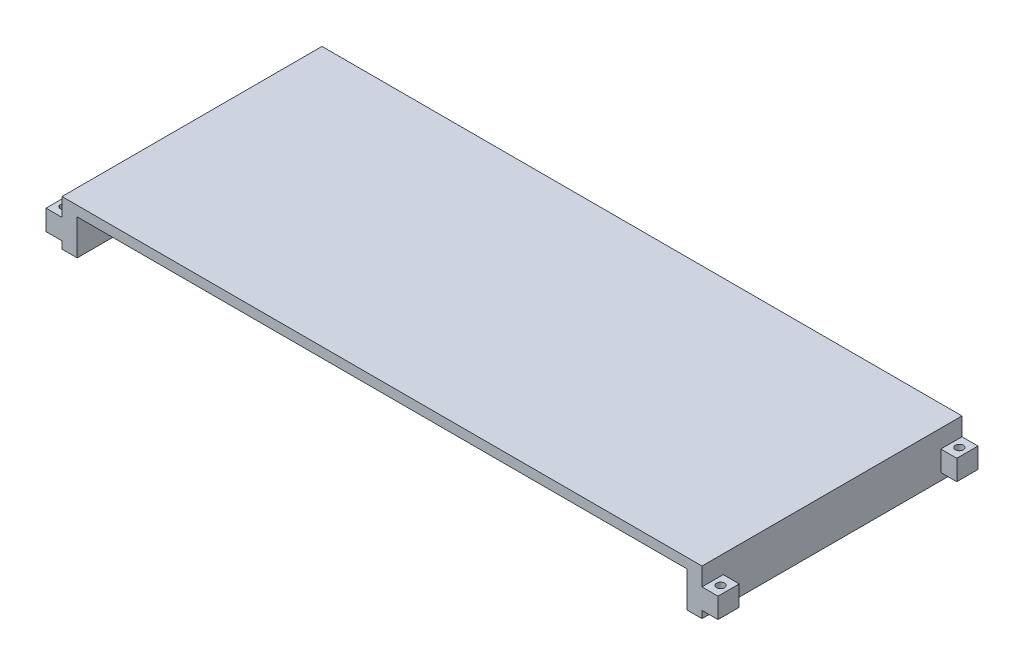
ISO-10303-21;
HEADER;
FILE_DESCRIPTION(('STEP AP214'),'2;1');
FILE_NAME('part.step','',(''),(''),'','','');
FILE_SCHEMA(('AUTOMOTIVE_DESIGN { 1 0 10303 214 1 1 1 1 }'));
ENDSEC;
DATA;
#1=APPLICATION_CONTEXT('core data for automotive mechanical design processes');
#2=APPLICATION_PROTOCOL_DEFINITION('international standard','automotive_design',2000,#1);
#3=PRODUCT_CONTEXT('',#1,'mechanical');
#4=PRODUCT('Part','Part','',(#3));
#5=PRODUCT_RELATED_PRODUCT_CATEGORY('part','',(#4));
#6=PRODUCT_DEFINITION_FORMATION('','',#4);
#7=PRODUCT_DEFINITION_CONTEXT('part definition',#1,'design');
#8=PRODUCT_DEFINITION('design','',#6,#7);
#9=PRODUCT_DEFINITION_SHAPE('','',#8);
#10=(LENGTH_UNIT() NAMED_UNIT(*) SI_UNIT(.MILLI.,.METRE.));
#11=(NAMED_UNIT(*) PLANE_ANGLE_UNIT() SI_UNIT($,.RADIAN.));
#12=(NAMED_UNIT(*) SI_UNIT($,.STERADIAN.) SOLID_ANGLE_UNIT());
#13=UNCERTAINTY_MEASURE_WITH_UNIT(LENGTH_MEASURE(1.E-05),#10,'distance_accuracy_value','');
#14=(GEOMETRIC_REPRESENTATION_CONTEXT(3) GLOBAL_UNCERTAINTY_ASSIGNED_CONTEXT((#13)) GLOBAL_UNIT_ASSIGNED_CONTEXT((#10,
#11,#12)) REPRESENTATION_CONTEXT('',''));
#15=CARTESIAN_POINT('',(0.,0.,0.));
#16=DIRECTION('',(0.,0.,1.));
#17=DIRECTION('',(1.,0.,0.));
#18=AXIS2_PLACEMENT_3D('',#15,#16,#17);
#19=CARTESIAN_POINT('',(0.,25.,0.));
#20=DIRECTION('',(1.,0.,0.));
#21=DIRECTION('',(0.,0.,-1.));
#22=AXIS2_PLACEMENT_3D('',#19,#20,#21);
#23=PLANE('',#22);
#24=DIRECTION('',(0.,0.,-1.));
#25=VECTOR('',#24,1.);
#26=CARTESIAN_POINT('',(0.,-20.2,650.));
#27=LINE('',#26,#25);
#28=CARTESIAN_POINT('',(0.,-20.2,650.));
#29=VERTEX_POINT('',#28);
#30=CARTESIAN_POINT('',(0.,-20.2,597.));
#31=VERTEX_POINT('',#30);
#32=EDGE_CURVE('E319',#29,#31,#27,.T.);
#33=ORIENTED_EDGE('',*,*,#32,.F.);
#34=DIRECTION('',(0.,-1.,0.));
#35=VECTOR('',#34,1.);
#36=CARTESIAN_POINT('',(0.,25.,650.));
#37=LINE('',#36,#35);
#38=CARTESIAN_POINT('',(0.,25.,650.));
#39=VERTEX_POINT('',#38);
#40=EDGE_CURVE('E11',#39,#29,#37,.T.);
#41=ORIENTED_EDGE('',*,*,#40,.F.);
#42=DIRECTION('',(0.,0.,1.));
#43=VECTOR('',#42,1.);
#44=CARTESIAN_POINT('',(0.,25.,0.));
#45=LINE('',#44,#43);
#46=CARTESIAN_POINT('',(0.,25.,0.));
#47=VERTEX_POINT('',#46);
#48=EDGE_CURVE('E420',#47,#39,#45,.T.);
#49=ORIENTED_EDGE('',*,*,#48,.F.);
#50=DIRECTION('',(0.,-1.,0.));
#51=VECTOR('',#50,1.);
#52=CARTESIAN_POINT('',(0.,25.,0.));
#53=LINE('',#52,#51);
#54=CARTESIAN_POINT('',(0.,-20.2,0.));
#55=VERTEX_POINT('',#54);
#56=EDGE_CURVE('E435',#47,#55,#53,.T.);
#57=ORIENTED_EDGE('',*,*,#56,.T.);
#58=DIRECTION('',(0.,0.,-1.));
#59=VECTOR('',#58,1.);
#60=CARTESIAN_POINT('',(0.,-20.2,0.));
#61=LINE('',#60,#59);
#62=CARTESIAN_POINT('',(0.,-20.2,53.));
#63=VERTEX_POINT('',#62);
#64=EDGE_CURVE('E333',#63,#55,#61,.T.);
#65=ORIENTED_EDGE('',*,*,#64,.F.);
#66=DIRECTION('',(0.,1.,0.));
#67=VECTOR('',#66,1.);
#68=CARTESIAN_POINT('',(0.,-71.,53.));
#69=LINE('',#68,#67);
#70=CARTESIAN_POINT('',(0.,-71.,53.));
#71=VERTEX_POINT('',#70);
#72=EDGE_CURVE('E342',#71,#63,#69,.T.);
#73=ORIENTED_EDGE('',*,*,#72,.F.);
#74=DIRECTION('',(0.,0.,1.));
#75=VECTOR('',#74,1.);
#76=CARTESIAN_POINT('',(0.,-71.,0.));
#77=LINE('',#76,#75);
#78=CARTESIAN_POINT('',(0.,-71.,0.));
#79=VERTEX_POINT('',#78);
#80=EDGE_CURVE('E321',#79,#71,#77,.T.);
#81=ORIENTED_EDGE('',*,*,#80,.F.);
#82=CARTESIAN_POINT('',(0.,-89.,0.));
#83=VERTEX_POINT('',#82);
#84=EDGE_CURVE('E430',#79,#83,#53,.T.);
#85=ORIENTED_EDGE('',*,*,#84,.T.);
#86=DIRECTION('',(0.,0.,-1.));
#87=VECTOR('',#86,1.);
#88=CARTESIAN_POINT('',(0.,-89.,0.));
#89=LINE('',#88,#87);
#90=CARTESIAN_POINT('',(0.,-89.,650.));
#91=VERTEX_POINT('',#90);
#92=EDGE_CURVE('E359',#91,#83,#89,.T.);
#93=ORIENTED_EDGE('',*,*,#92,.F.);
#94=CARTESIAN_POINT('',(0.,-71.,650.));
#95=VERTEX_POINT('',#94);
#96=EDGE_CURVE('E46',#95,#91,#37,.T.);
#97=ORIENTED_EDGE('',*,*,#96,.F.);
#98=DIRECTION('',(0.,0.,1.));
#99=VECTOR('',#98,1.);
#100=CARTESIAN_POINT('',(0.,-71.,650.));
#101=LINE('',#100,#99);
#102=CARTESIAN_POINT('',(0.,-71.,597.));
#103=VERTEX_POINT('',#102);
#104=EDGE_CURVE('E313',#103,#95,#101,.T.);
#105=ORIENTED_EDGE('',*,*,#104,.F.);
#106=DIRECTION('',(0.,-1.,0.));
#107=VECTOR('',#106,1.);
#108=CARTESIAN_POINT('',(0.,-71.,597.));
#109=LINE('',#108,#107);
#110=EDGE_CURVE('E316',#31,#103,#109,.T.);
#111=ORIENTED_EDGE('',*,*,#110,.F.);
#112=EDGE_LOOP('',(#33,#41,#49,#57,#65,#73,#81,#85,#93,#97,#105,#111));
#113=FACE_BOUND('',#112,.T.);
#114=ADVANCED_FACE('F38',(#113),#23,.F.);
#115=CARTESIAN_POINT('',(0.,0.,0.));
#116=DIRECTION('',(0.,1.,0.));
#117=DIRECTION('',(0.,0.,1.));
#118=AXIS2_PLACEMENT_3D('',#115,#116,#117);
#119=PLANE('',#118);
#120=DIRECTION('',(0.,0.,-1.));
#121=VECTOR('',#120,1.);
#122=CARTESIAN_POINT('',(1562.,0.,-2.83360843866747E-11));
#123=LINE('',#122,#121);
#124=CARTESIAN_POINT('',(1562.00000000001,0.,306.));
#125=VERTEX_POINT('',#124);
#126=CARTESIAN_POINT('',(1562.,0.,0.));
#127=VERTEX_POINT('',#126);
#128=EDGE_CURVE('E391',#125,#127,#123,.T.);
#129=ORIENTED_EDGE('',*,*,#128,.F.);
#130=DIRECTION('',(1.,0.,0.));
#131=VECTOR('',#130,1.);
#132=CARTESIAN_POINT('',(0.,0.,306.));
#133=LINE('',#132,#131);
#134=CARTESIAN_POINT('',(38.0000000000001,0.,306.));
#135=VERTEX_POINT('',#134);
#136=EDGE_CURVE('E389',#135,#125,#133,.T.);
#137=ORIENTED_EDGE('',*,*,#136,.F.);
#138=DIRECTION('',(0.,0.,-1.));
#139=VECTOR('',#138,1.);
#140=CARTESIAN_POINT('',(38.,0.,0.));
#141=LINE('',#140,#139);
#142=CARTESIAN_POINT('',(38.,0.,0.));
#143=VERTEX_POINT('',#142);
#144=EDGE_CURVE('E358',#135,#143,#141,.T.);
#145=ORIENTED_EDGE('',*,*,#144,.T.);
#146=DIRECTION('',(-1.,0.,0.));
#147=VECTOR('',#146,1.);
#148=CARTESIAN_POINT('',(0.,0.,0.));
#149=LINE('',#148,#147);
#150=EDGE_CURVE('E424',#127,#143,#149,.T.);
#151=ORIENTED_EDGE('',*,*,#150,.F.);
#152=EDGE_LOOP('',(#129,#137,#145,#151));
#153=FACE_BOUND('',#152,.T.);
#154=ADVANCED_FACE('F466',(#153),#119,.F.);
#155=CARTESIAN_POINT('',(0.,25.,650.));
#156=DIRECTION('',(0.,0.,-1.));
#157=DIRECTION('',(-1.,0.,0.));
#158=AXIS2_PLACEMENT_3D('',#155,#156,#157);
#159=PLANE('',#158);
#160=ORIENTED_EDGE('',*,*,#40,.T.);
#161=DIRECTION('',(1.,0.,0.));
#162=VECTOR('',#161,1.);
#163=CARTESIAN_POINT('',(-39.9999999999999,-20.2,650.));
#164=LINE('',#163,#162);
#165=CARTESIAN_POINT('',(-39.9999999999999,-20.2,650.));
#166=VERTEX_POINT('',#165);
#167=EDGE_CURVE('E302',#166,#29,#164,.T.);
#168=ORIENTED_EDGE('',*,*,#167,.F.);
#169=DIRECTION('',(0.,1.,0.));
#170=VECTOR('',#169,1.);
#171=CARTESIAN_POINT('',(-39.9999999999999,-71.,650.));
#172=LINE('',#171,#170);
#173=CARTESIAN_POINT('',(-39.9999999999999,-71.,650.));
#174=VERTEX_POINT('',#173);
#175=EDGE_CURVE('E317',#174,#166,#172,.T.);
#176=ORIENTED_EDGE('',*,*,#175,.F.);
#177=DIRECTION('',(1.,0.,0.));
#178=VECTOR('',#177,1.);
#179=CARTESIAN_POINT('',(-39.9999999999999,-71.,650.));
#180=LINE('',#179,#178);
#181=EDGE_CURVE('E310',#174,#95,#180,.T.);
#182=ORIENTED_EDGE('',*,*,#181,.T.);
#183=ORIENTED_EDGE('',*,*,#96,.T.);
#184=DIRECTION('',(-1.,0.,0.));
#185=VECTOR('',#184,1.);
#186=CARTESIAN_POINT('',(0.,-89.,650.));
#187=LINE('',#186,#185);
#188=CARTESIAN_POINT('',(38.0000000000001,-89.,650.));
#189=VERTEX_POINT('',#188);
#190=EDGE_CURVE('E379',#189,#91,#187,.T.);
#191=ORIENTED_EDGE('',*,*,#190,.F.);
#192=DIRECTION('',(0.,1.,0.));
#193=VECTOR('',#192,1.);
#194=CARTESIAN_POINT('',(38.0000000000001,-89.,650.));
#195=LINE('',#194,#193);
#196=CARTESIAN_POINT('',(38.0000000000001,0.,650.));
#197=VERTEX_POINT('',#196);
#198=EDGE_CURVE('E401',#189,#197,#195,.T.);
#199=ORIENTED_EDGE('',*,*,#198,.T.);
#200=DIRECTION('',(1.,0.,0.));
#201=VECTOR('',#200,1.);
#202=CARTESIAN_POINT('',(0.,0.,650.));
#203=LINE('',#202,#201);
#204=CARTESIAN_POINT('',(1562.,0.,650.));
#205=VERTEX_POINT('',#204);
#206=EDGE_CURVE('E419',#197,#205,#203,.T.);
#207=ORIENTED_EDGE('',*,*,#206,.T.);
#208=DIRECTION('',(0.,1.,0.));
#209=VECTOR('',#208,1.);
#210=CARTESIAN_POINT('',(1562.,-89.,650.));
#211=LINE('',#210,#209);
#212=CARTESIAN_POINT('',(1562.,-89.,650.));
#213=VERTEX_POINT('',#212);
#214=EDGE_CURVE('E407',#213,#205,#211,.T.);
#215=ORIENTED_EDGE('',*,*,#214,.F.);
#216=CARTESIAN_POINT('',(1600.,-89.,650.));
#217=VERTEX_POINT('',#216);
#218=EDGE_CURVE('E376',#217,#213,#187,.T.);
#219=ORIENTED_EDGE('',*,*,#218,.F.);
#220=DIRECTION('',(0.,-1.,0.));
#221=VECTOR('',#220,1.);
#222=CARTESIAN_POINT('',(1600.,25.,650.));
#223=LINE('',#222,#221);
#224=CARTESIAN_POINT('',(1600.,-71.,650.));
#225=VERTEX_POINT('',#224);
#226=EDGE_CURVE('E231',#225,#217,#223,.T.);
#227=ORIENTED_EDGE('',*,*,#226,.F.);
#228=DIRECTION('',(-1.,0.,0.));
#229=VECTOR('',#228,1.);
#230=CARTESIAN_POINT('',(1640.,-71.,650.));
#231=LINE('',#230,#229);
#232=CARTESIAN_POINT('',(1640.,-71.,650.));
#233=VERTEX_POINT('',#232);
#234=EDGE_CURVE('E225',#233,#225,#231,.T.);
#235=ORIENTED_EDGE('',*,*,#234,.F.);
#236=DIRECTION('',(0.,1.,0.));
#237=VECTOR('',#236,1.);
#238=CARTESIAN_POINT('',(1640.,-71.,650.));
#239=LINE('',#238,#237);
#240=CARTESIAN_POINT('',(1640.,-20.2,650.));
#241=VERTEX_POINT('',#240);
#242=EDGE_CURVE('E228',#233,#241,#239,.T.);
#243=ORIENTED_EDGE('',*,*,#242,.T.);
#244=DIRECTION('',(-1.,0.,0.));
#245=VECTOR('',#244,1.);
#246=CARTESIAN_POINT('',(1640.,-20.2,650.));
#247=LINE('',#246,#245);
#248=CARTESIAN_POINT('',(1600.,-20.2,650.));
#249=VERTEX_POINT('',#248);
#250=EDGE_CURVE('E256',#241,#249,#247,.T.);
#251=ORIENTED_EDGE('',*,*,#250,.T.);
#252=CARTESIAN_POINT('',(1600.,25.,650.));
#253=VERTEX_POINT('',#252);
#254=EDGE_CURVE('E441',#253,#249,#223,.T.);
#255=ORIENTED_EDGE('',*,*,#254,.F.);
#256=DIRECTION('',(1.,0.,0.));
#257=VECTOR('',#256,1.);
#258=CARTESIAN_POINT('',(0.,25.,650.));
#259=LINE('',#258,#257);
#260=EDGE_CURVE('E423',#39,#253,#259,.T.);
#261=ORIENTED_EDGE('',*,*,#260,.F.);
#262=EDGE_LOOP('',(#160,#168,#176,#182,#183,#191,#199,#207,#215,#219,#227,#235,#243,#251,#255,#261));
#263=FACE_BOUND('',#262,.T.);
#264=ADVANCED_FACE('F227',(#263),#159,.F.);
#265=CARTESIAN_POINT('',(1600.,25.,0.));
#266=DIRECTION('',(-1.,0.,0.));
#267=DIRECTION('',(0.,0.,1.));
#268=AXIS2_PLACEMENT_3D('',#265,#266,#267);
#269=PLANE('',#268);
#270=DIRECTION('',(0.,-1.,0.));
#271=VECTOR('',#270,1.);
#272=CARTESIAN_POINT('',(1600.,-71.,597.));
#273=LINE('',#272,#271);
#274=CARTESIAN_POINT('',(1600.,-20.2,597.));
#275=VERTEX_POINT('',#274);
#276=CARTESIAN_POINT('',(1600.,-71.,597.));
#277=VERTEX_POINT('',#276);
#278=EDGE_CURVE('E54',#275,#277,#273,.T.);
#279=ORIENTED_EDGE('',*,*,#278,.T.);
#280=DIRECTION('',(0.,0.,1.));
#281=VECTOR('',#280,1.);
#282=CARTESIAN_POINT('',(1600.,-71.,650.));
#283=LINE('',#282,#281);
#284=EDGE_CURVE('E257',#277,#225,#283,.T.);
#285=ORIENTED_EDGE('',*,*,#284,.T.);
#286=ORIENTED_EDGE('',*,*,#226,.T.);
#287=DIRECTION('',(0.,0.,1.));
#288=VECTOR('',#287,1.);
#289=CARTESIAN_POINT('',(1600.,-89.,0.));
#290=LINE('',#289,#288);
#291=CARTESIAN_POINT('',(1600.,-89.,0.));
#292=VERTEX_POINT('',#291);
#293=EDGE_CURVE('E373',#292,#217,#290,.T.);
#294=ORIENTED_EDGE('',*,*,#293,.F.);
#295=DIRECTION('',(0.,-1.,0.));
#296=VECTOR('',#295,1.);
#297=CARTESIAN_POINT('',(1600.,25.,0.));
#298=LINE('',#297,#296);
#299=CARTESIAN_POINT('',(1600.,-71.,-2.73285667600039E-13));
#300=VERTEX_POINT('',#299);
#301=EDGE_CURVE('E437',#300,#292,#298,.T.);
#302=ORIENTED_EDGE('',*,*,#301,.F.);
#303=DIRECTION('',(0.,0.,1.));
#304=VECTOR('',#303,1.);
#305=CARTESIAN_POINT('',(1600.,-71.,-2.73285667600039E-13));
#306=LINE('',#305,#304);
#307=CARTESIAN_POINT('',(1600.,-71.,52.9999999999997));
#308=VERTEX_POINT('',#307);
#309=EDGE_CURVE('E271',#300,#308,#306,.T.);
#310=ORIENTED_EDGE('',*,*,#309,.T.);
#311=DIRECTION('',(0.,1.,0.));
#312=VECTOR('',#311,1.);
#313=CARTESIAN_POINT('',(1600.,-71.,52.9999999999997));
#314=LINE('',#313,#312);
#315=CARTESIAN_POINT('',(1600.,-20.2,52.9999999999997));
#316=VERTEX_POINT('',#315);
#317=EDGE_CURVE('E281',#308,#316,#314,.T.);
#318=ORIENTED_EDGE('',*,*,#317,.T.);
#319=DIRECTION('',(0.,0.,-1.));
#320=VECTOR('',#319,1.);
#321=CARTESIAN_POINT('',(1600.,-20.2,-2.73285667600039E-13));
#322=LINE('',#321,#320);
#323=CARTESIAN_POINT('',(1600.,-20.2,0.));
#324=VERTEX_POINT('',#323);
#325=EDGE_CURVE('E236',#316,#324,#322,.T.);
#326=ORIENTED_EDGE('',*,*,#325,.T.);
#327=CARTESIAN_POINT('',(1600.,25.,0.));
#328=VERTEX_POINT('',#327);
#329=EDGE_CURVE('E438',#328,#324,#298,.T.);
#330=ORIENTED_EDGE('',*,*,#329,.F.);
#331=DIRECTION('',(0.,0.,-1.));
#332=VECTOR('',#331,1.);
#333=CARTESIAN_POINT('',(1600.,25.,0.));
#334=LINE('',#333,#332);
#335=EDGE_CURVE('E426',#253,#328,#334,.T.);
#336=ORIENTED_EDGE('',*,*,#335,.F.);
#337=ORIENTED_EDGE('',*,*,#254,.T.);
#338=DIRECTION('',(0.,0.,-1.));
#339=VECTOR('',#338,1.);
#340=CARTESIAN_POINT('',(1600.,-20.2,650.));
#341=LINE('',#340,#339);
#342=EDGE_CURVE('E247',#249,#275,#341,.T.);
#343=ORIENTED_EDGE('',*,*,#342,.T.);
#344=EDGE_LOOP('',(#279,#285,#286,#294,#302,#310,#318,#326,#330,#336,#337,#343));
#345=FACE_BOUND('',#344,.T.);
#346=ADVANCED_FACE('F549',(#345),#269,.F.);
#347=CARTESIAN_POINT('',(0.,25.,0.));
#348=DIRECTION('',(0.,0.,1.));
#349=DIRECTION('',(1.,0.,0.));
#350=AXIS2_PLACEMENT_3D('',#347,#348,#349);
#351=PLANE('',#350);
#352=ORIENTED_EDGE('',*,*,#329,.T.);
#353=DIRECTION('',(-1.,0.,0.));
#354=VECTOR('',#353,1.);
#355=CARTESIAN_POINT('',(1640.,-20.2,-2.82051363783451E-13));
#356=LINE('',#355,#354);
#357=CARTESIAN_POINT('',(1640.,-20.2,-2.82051363783451E-13));
#358=VERTEX_POINT('',#357);
#359=EDGE_CURVE('E62',#358,#324,#356,.T.);
#360=ORIENTED_EDGE('',*,*,#359,.F.);
#361=DIRECTION('',(0.,-1.,0.));
#362=VECTOR('',#361,1.);
#363=CARTESIAN_POINT('',(1640.,-71.,-2.82051363783451E-13));
#364=LINE('',#363,#362);
#365=CARTESIAN_POINT('',(1640.,-71.,-2.82051363783451E-13));
#366=VERTEX_POINT('',#365);
#367=EDGE_CURVE('E267',#358,#366,#364,.T.);
#368=ORIENTED_EDGE('',*,*,#367,.T.);
#369=DIRECTION('',(-1.,0.,0.));
#370=VECTOR('',#369,1.);
#371=CARTESIAN_POINT('',(1640.,-71.,-2.82051363783451E-13));
#372=LINE('',#371,#370);
#373=EDGE_CURVE('E279',#366,#300,#372,.T.);
#374=ORIENTED_EDGE('',*,*,#373,.T.);
#375=ORIENTED_EDGE('',*,*,#301,.T.);
#376=DIRECTION('',(1.,0.,0.));
#377=VECTOR('',#376,1.);
#378=CARTESIAN_POINT('',(0.,-89.,0.));
#379=LINE('',#378,#377);
#380=CARTESIAN_POINT('',(1562.,-89.,0.));
#381=VERTEX_POINT('',#380);
#382=EDGE_CURVE('E366',#381,#292,#379,.T.);
#383=ORIENTED_EDGE('',*,*,#382,.F.);
#384=DIRECTION('',(0.,1.,0.));
#385=VECTOR('',#384,1.);
#386=CARTESIAN_POINT('',(1562.,-89.,0.));
#387=LINE('',#386,#385);
#388=EDGE_CURVE('E409',#381,#127,#387,.T.);
#389=ORIENTED_EDGE('',*,*,#388,.T.);
#390=ORIENTED_EDGE('',*,*,#150,.T.);
#391=DIRECTION('',(0.,1.,0.));
#392=VECTOR('',#391,1.);
#393=CARTESIAN_POINT('',(38.,-89.,0.));
#394=LINE('',#393,#392);
#395=CARTESIAN_POINT('',(38.,-89.,0.));
#396=VERTEX_POINT('',#395);
#397=EDGE_CURVE('E417',#396,#143,#394,.T.);
#398=ORIENTED_EDGE('',*,*,#397,.F.);
#399=EDGE_CURVE('E362',#83,#396,#379,.T.);
#400=ORIENTED_EDGE('',*,*,#399,.F.);
#401=ORIENTED_EDGE('',*,*,#84,.F.);
#402=DIRECTION('',(1.,0.,0.));
#403=VECTOR('',#402,1.);
#404=CARTESIAN_POINT('',(-40.,-71.,0.));
#405=LINE('',#404,#403);
#406=CARTESIAN_POINT('',(-40.,-71.,0.));
#407=VERTEX_POINT('',#406);
#408=EDGE_CURVE('E355',#407,#79,#405,.T.);
#409=ORIENTED_EDGE('',*,*,#408,.F.);
#410=DIRECTION('',(0.,-1.,0.));
#411=VECTOR('',#410,1.);
#412=CARTESIAN_POINT('',(-40.,-71.,0.));
#413=LINE('',#412,#411);
#414=CARTESIAN_POINT('',(-40.,-20.2,0.));
#415=VERTEX_POINT('',#414);
#416=EDGE_CURVE('E329',#415,#407,#413,.T.);
#417=ORIENTED_EDGE('',*,*,#416,.F.);
#418=DIRECTION('',(1.,0.,0.));
#419=VECTOR('',#418,1.);
#420=CARTESIAN_POINT('',(-40.,-20.2,0.));
#421=LINE('',#420,#419);
#422=EDGE_CURVE('E339',#415,#55,#421,.T.);
#423=ORIENTED_EDGE('',*,*,#422,.T.);
#424=ORIENTED_EDGE('',*,*,#56,.F.);
#425=DIRECTION('',(-1.,0.,0.));
#426=VECTOR('',#425,1.);
#427=CARTESIAN_POINT('',(0.,25.,0.));
#428=LINE('',#427,#426);
#429=EDGE_CURVE('E428',#328,#47,#428,.T.);
#430=ORIENTED_EDGE('',*,*,#429,.F.);
#431=EDGE_LOOP('',(#352,#360,#368,#374,#375,#383,#389,#390,#398,#400,#401,#409,#417,#423,#424,#430));
#432=FACE_BOUND('',#431,.T.);
#433=ADVANCED_FACE('F494',(#432),#351,.F.);
#434=CARTESIAN_POINT('',(0.,25.,0.));
#435=DIRECTION('',(0.,1.,0.));
#436=DIRECTION('',(0.,0.,1.));
#437=AXIS2_PLACEMENT_3D('',#434,#435,#436);
#438=PLANE('',#437);
#439=ORIENTED_EDGE('',*,*,#48,.T.);
#440=ORIENTED_EDGE('',*,*,#260,.T.);
#441=ORIENTED_EDGE('',*,*,#335,.T.);
#442=ORIENTED_EDGE('',*,*,#429,.T.);
#443=EDGE_LOOP('',(#439,#440,#441,#442));
#444=FACE_BOUND('',#443,.T.);
#445=ADVANCED_FACE('F486',(#444),#438,.T.);
#446=ORIENTED_EDGE('',*,*,#206,.F.);
#447=DIRECTION('',(0.,0.,-1.));
#448=VECTOR('',#447,1.);
#449=CARTESIAN_POINT('',(38.,0.,0.));
#450=LINE('',#449,#448);
#451=CARTESIAN_POINT('',(38.0000000000001,0.,344.));
#452=VERTEX_POINT('',#451);
#453=EDGE_CURVE('E363',#197,#452,#450,.T.);
#454=ORIENTED_EDGE('',*,*,#453,.T.);
#455=DIRECTION('',(1.,0.,0.));
#456=VECTOR('',#455,1.);
#457=CARTESIAN_POINT('',(0.,0.,344.));
#458=LINE('',#457,#456);
#459=CARTESIAN_POINT('',(1562.,0.,344.));
#460=VERTEX_POINT('',#459);
#461=EDGE_CURVE('E396',#452,#460,#458,.T.);
#462=ORIENTED_EDGE('',*,*,#461,.T.);
#463=DIRECTION('',(0.,0.,-1.));
#464=VECTOR('',#463,1.);
#465=CARTESIAN_POINT('',(1562.,0.,0.));
#466=LINE('',#465,#464);
#467=EDGE_CURVE('E393',#205,#460,#466,.T.);
#468=ORIENTED_EDGE('',*,*,#467,.F.);
#469=EDGE_LOOP('',(#446,#454,#462,#468));
#470=FACE_BOUND('',#469,.T.);
#471=ADVANCED_FACE('F473',(#470),#119,.F.);
#472=CARTESIAN_POINT('',(38.,-89.,0.));
#473=DIRECTION('',(1.,0.,0.));
#474=DIRECTION('',(0.,0.,-1.));
#475=AXIS2_PLACEMENT_3D('',#472,#473,#474);
#476=PLANE('',#475);
#477=ORIENTED_EDGE('',*,*,#144,.F.);
#478=DIRECTION('',(0.,1.,0.));
#479=VECTOR('',#478,1.);
#480=CARTESIAN_POINT('',(38.0000000000001,-89.,306.));
#481=LINE('',#480,#479);
#482=CARTESIAN_POINT('',(38.0000000000001,-89.,306.));
#483=VERTEX_POINT('',#482);
#484=EDGE_CURVE('E415',#483,#135,#481,.T.);
#485=ORIENTED_EDGE('',*,*,#484,.F.);
#486=DIRECTION('',(0.,0.,-1.));
#487=VECTOR('',#486,1.);
#488=CARTESIAN_POINT('',(38.,-89.,0.));
#489=LINE('',#488,#487);
#490=EDGE_CURVE('E365',#483,#396,#489,.T.);
#491=ORIENTED_EDGE('',*,*,#490,.T.);
#492=ORIENTED_EDGE('',*,*,#397,.T.);
#493=EDGE_LOOP('',(#477,#485,#491,#492));
#494=FACE_BOUND('',#493,.T.);
#495=ADVANCED_FACE('F538',(#494),#476,.T.);
#496=CARTESIAN_POINT('',(0.,-89.,306.));
#497=DIRECTION('',(0.,0.,1.));
#498=DIRECTION('',(1.,0.,0.));
#499=AXIS2_PLACEMENT_3D('',#496,#497,#498);
#500=PLANE('',#499);
#501=ORIENTED_EDGE('',*,*,#136,.T.);
#502=DIRECTION('',(0.,1.,0.));
#503=VECTOR('',#502,1.);
#504=CARTESIAN_POINT('',(1562.00000000001,-89.,306.));
#505=LINE('',#504,#503);
#506=CARTESIAN_POINT('',(1562.00000000001,-89.,306.));
#507=VERTEX_POINT('',#506);
#508=EDGE_CURVE('E412',#507,#125,#505,.T.);
#509=ORIENTED_EDGE('',*,*,#508,.F.);
#510=DIRECTION('',(1.,0.,0.));
#511=VECTOR('',#510,1.);
#512=CARTESIAN_POINT('',(0.,-89.,306.));
#513=LINE('',#512,#511);
#514=EDGE_CURVE('E369',#483,#507,#513,.T.);
#515=ORIENTED_EDGE('',*,*,#514,.F.);
#516=ORIENTED_EDGE('',*,*,#484,.T.);
#517=EDGE_LOOP('',(#501,#509,#515,#516));
#518=FACE_BOUND('',#517,.T.);
#519=ADVANCED_FACE('F534',(#518),#500,.F.);
#520=CARTESIAN_POINT('',(1562.,-89.,-2.83360843866747E-11));
#521=DIRECTION('',(1.,0.,0.));
#522=DIRECTION('',(0.,0.,-1.));
#523=AXIS2_PLACEMENT_3D('',#520,#521,#522);
#524=PLANE('',#523);
#525=ORIENTED_EDGE('',*,*,#128,.T.);
#526=ORIENTED_EDGE('',*,*,#388,.F.);
#527=DIRECTION('',(0.,0.,-1.));
#528=VECTOR('',#527,1.);
#529=CARTESIAN_POINT('',(1562.,-89.,-2.83360843866747E-11));
#530=LINE('',#529,#528);
#531=EDGE_CURVE('E371',#507,#381,#530,.T.);
#532=ORIENTED_EDGE('',*,*,#531,.F.);
#533=ORIENTED_EDGE('',*,*,#508,.T.);
#534=EDGE_LOOP('',(#525,#526,#532,#533));
#535=FACE_BOUND('',#534,.T.);
#536=ADVANCED_FACE('F530',(#535),#524,.F.);
#537=CARTESIAN_POINT('',(1562.,-89.,0.));
#538=DIRECTION('',(1.,0.,0.));
#539=DIRECTION('',(0.,0.,-1.));
#540=AXIS2_PLACEMENT_3D('',#537,#538,#539);
#541=PLANE('',#540);
#542=ORIENTED_EDGE('',*,*,#467,.T.);
#543=DIRECTION('',(0.,1.,0.));
#544=VECTOR('',#543,1.);
#545=CARTESIAN_POINT('',(1562.,-89.,344.));
#546=LINE('',#545,#544);
#547=CARTESIAN_POINT('',(1562.,-89.,344.));
#548=VERTEX_POINT('',#547);
#549=EDGE_CURVE('E405',#548,#460,#546,.T.);
#550=ORIENTED_EDGE('',*,*,#549,.F.);
#551=DIRECTION('',(0.,0.,-1.));
#552=VECTOR('',#551,1.);
#553=CARTESIAN_POINT('',(1562.,-89.,0.));
#554=LINE('',#553,#552);
#555=EDGE_CURVE('E378',#213,#548,#554,.T.);
#556=ORIENTED_EDGE('',*,*,#555,.F.);
#557=ORIENTED_EDGE('',*,*,#214,.T.);
#558=EDGE_LOOP('',(#542,#550,#556,#557));
#559=FACE_BOUND('',#558,.T.);
#560=ADVANCED_FACE('F526',(#559),#541,.F.);
#561=CARTESIAN_POINT('',(0.,-89.,344.));
#562=DIRECTION('',(0.,0.,1.));
#563=DIRECTION('',(1.,0.,0.));
#564=AXIS2_PLACEMENT_3D('',#561,#562,#563);
#565=PLANE('',#564);
#566=ORIENTED_EDGE('',*,*,#461,.F.);
#567=DIRECTION('',(0.,1.,0.));
#568=VECTOR('',#567,1.);
#569=CARTESIAN_POINT('',(38.0000000000001,-89.,344.));
#570=LINE('',#569,#568);
#571=CARTESIAN_POINT('',(38.0000000000001,-89.,344.));
#572=VERTEX_POINT('',#571);
#573=EDGE_CURVE('E403',#572,#452,#570,.T.);
#574=ORIENTED_EDGE('',*,*,#573,.F.);
#575=DIRECTION('',(1.,0.,0.));
#576=VECTOR('',#575,1.);
#577=CARTESIAN_POINT('',(0.,-89.,344.));
#578=LINE('',#577,#576);
#579=EDGE_CURVE('E381',#572,#548,#578,.T.);
#580=ORIENTED_EDGE('',*,*,#579,.T.);
#581=ORIENTED_EDGE('',*,*,#549,.T.);
#582=EDGE_LOOP('',(#566,#574,#580,#581));
#583=FACE_BOUND('',#582,.T.);
#584=ADVANCED_FACE('F522',(#583),#565,.T.);
#585=CARTESIAN_POINT('',(38.,-89.,0.));
#586=DIRECTION('',(1.,0.,0.));
#587=DIRECTION('',(0.,0.,-1.));
#588=AXIS2_PLACEMENT_3D('',#585,#586,#587);
#589=PLANE('',#588);
#590=ORIENTED_EDGE('',*,*,#453,.F.);
#591=ORIENTED_EDGE('',*,*,#198,.F.);
#592=DIRECTION('',(0.,0.,-1.));
#593=VECTOR('',#592,1.);
#594=CARTESIAN_POINT('',(38.,-89.,0.));
#595=LINE('',#594,#593);
#596=EDGE_CURVE('E384',#189,#572,#595,.T.);
#597=ORIENTED_EDGE('',*,*,#596,.T.);
#598=ORIENTED_EDGE('',*,*,#573,.T.);
#599=EDGE_LOOP('',(#590,#591,#597,#598));
#600=FACE_BOUND('',#599,.T.);
#601=ADVANCED_FACE('F514',(#600),#589,.T.);
#602=CARTESIAN_POINT('',(0.,-89.,0.));
#603=DIRECTION('',(0.,-1.,0.));
#604=DIRECTION('',(0.,0.,-1.));
#605=AXIS2_PLACEMENT_3D('',#602,#603,#604);
#606=PLANE('',#605);
#607=ORIENTED_EDGE('',*,*,#92,.T.);
#608=ORIENTED_EDGE('',*,*,#399,.T.);
#609=ORIENTED_EDGE('',*,*,#490,.F.);
#610=ORIENTED_EDGE('',*,*,#514,.T.);
#611=ORIENTED_EDGE('',*,*,#531,.T.);
#612=ORIENTED_EDGE('',*,*,#382,.T.);
#613=ORIENTED_EDGE('',*,*,#293,.T.);
#614=ORIENTED_EDGE('',*,*,#218,.T.);
#615=ORIENTED_EDGE('',*,*,#555,.T.);
#616=ORIENTED_EDGE('',*,*,#579,.F.);
#617=ORIENTED_EDGE('',*,*,#596,.F.);
#618=ORIENTED_EDGE('',*,*,#190,.T.);
#619=EDGE_LOOP('',(#607,#608,#609,#610,#611,#612,#613,#614,#615,#616,#617,#618));
#620=FACE_BOUND('',#619,.T.);
#621=ADVANCED_FACE('F506',(#620),#606,.T.);
#622=CARTESIAN_POINT('',(-40.,-71.,0.));
#623=DIRECTION('',(0.,1.,0.));
#624=DIRECTION('',(0.,0.,1.));
#625=AXIS2_PLACEMENT_3D('',#622,#623,#624);
#626=PLANE('',#625);
#627=CARTESIAN_POINT('',(-20.,-71.,26.5));
#628=DIRECTION('',(0.,-1.,0.));
#629=DIRECTION('',(0.,0.,-1.));
#630=AXIS2_PLACEMENT_3D('',#627,#628,#629);
#631=CIRCLE('',#630,10.);
#632=CARTESIAN_POINT('',(-20.,-71.,16.5));
#633=VERTEX_POINT('',#632);
#634=EDGE_CURVE('E293',#633,#633,#631,.T.);
#635=ORIENTED_EDGE('',*,*,#634,.F.);
#636=EDGE_LOOP('',(#635));
#637=FACE_BOUND('',#636,.T.);
#638=ORIENTED_EDGE('',*,*,#80,.T.);
#639=DIRECTION('',(1.,0.,0.));
#640=VECTOR('',#639,1.);
#641=CARTESIAN_POINT('',(-40.,-71.,53.));
#642=LINE('',#641,#640);
#643=CARTESIAN_POINT('',(-40.,-71.,53.));
#644=VERTEX_POINT('',#643);
#645=EDGE_CURVE('E352',#644,#71,#642,.T.);
#646=ORIENTED_EDGE('',*,*,#645,.F.);
#647=DIRECTION('',(0.,0.,1.));
#648=VECTOR('',#647,1.);
#649=CARTESIAN_POINT('',(-40.,-71.,0.));
#650=LINE('',#649,#648);
#651=EDGE_CURVE('E332',#407,#644,#650,.T.);
#652=ORIENTED_EDGE('',*,*,#651,.F.);
#653=ORIENTED_EDGE('',*,*,#408,.T.);
#654=EDGE_LOOP('',(#638,#646,#652,#653));
#655=FACE_BOUND('',#654,.T.);
#656=ADVANCED_FACE('F504',(#637,#655),#626,.F.);
#657=CARTESIAN_POINT('',(-40.,-71.,53.));
#658=DIRECTION('',(0.,0.,-1.));
#659=DIRECTION('',(-1.,0.,0.));
#660=AXIS2_PLACEMENT_3D('',#657,#658,#659);
#661=PLANE('',#660);
#662=ORIENTED_EDGE('',*,*,#72,.T.);
#663=DIRECTION('',(1.,0.,0.));
#664=VECTOR('',#663,1.);
#665=CARTESIAN_POINT('',(-40.,-20.2,53.));
#666=LINE('',#665,#664);
#667=CARTESIAN_POINT('',(-40.,-20.2,53.));
#668=VERTEX_POINT('',#667);
#669=EDGE_CURVE('E349',#668,#63,#666,.T.);
#670=ORIENTED_EDGE('',*,*,#669,.F.);
#671=DIRECTION('',(0.,1.,0.));
#672=VECTOR('',#671,1.);
#673=CARTESIAN_POINT('',(-40.,-71.,53.));
#674=LINE('',#673,#672);
#675=EDGE_CURVE('E335',#644,#668,#674,.T.);
#676=ORIENTED_EDGE('',*,*,#675,.F.);
#677=ORIENTED_EDGE('',*,*,#645,.T.);
#678=EDGE_LOOP('',(#662,#670,#676,#677));
#679=FACE_BOUND('',#678,.T.);
#680=ADVANCED_FACE('F502',(#679),#661,.F.);
#681=CARTESIAN_POINT('',(-40.,-20.2,0.));
#682=DIRECTION('',(0.,-1.,0.));
#683=DIRECTION('',(0.,0.,-1.));
#684=AXIS2_PLACEMENT_3D('',#681,#682,#683);
#685=PLANE('',#684);
#686=CARTESIAN_POINT('',(-20.,-20.2,26.5));
#687=DIRECTION('',(0.,-1.,0.));
#688=DIRECTION('',(0.,0.,-1.));
#689=AXIS2_PLACEMENT_3D('',#686,#687,#688);
#690=CIRCLE('',#689,10.);
#691=CARTESIAN_POINT('',(-20.,-20.2,16.5));
#692=VERTEX_POINT('',#691);
#693=EDGE_CURVE('E301',#692,#692,#690,.T.);
#694=ORIENTED_EDGE('',*,*,#693,.T.);
#695=EDGE_LOOP('',(#694));
#696=FACE_BOUND('',#695,.T.);
#697=ORIENTED_EDGE('',*,*,#64,.T.);
#698=ORIENTED_EDGE('',*,*,#422,.F.);
#699=DIRECTION('',(0.,0.,-1.));
#700=VECTOR('',#699,1.);
#701=CARTESIAN_POINT('',(-40.,-20.2,0.));
#702=LINE('',#701,#700);
#703=EDGE_CURVE('E337',#668,#415,#702,.T.);
#704=ORIENTED_EDGE('',*,*,#703,.F.);
#705=ORIENTED_EDGE('',*,*,#669,.T.);
#706=EDGE_LOOP('',(#697,#698,#704,#705));
#707=FACE_BOUND('',#706,.T.);
#708=ADVANCED_FACE('F446',(#696,#707),#685,.F.);
#709=CARTESIAN_POINT('',(-40.,0.,0.));
#710=DIRECTION('',(1.,0.,0.));
#711=DIRECTION('',(0.,0.,-1.));
#712=AXIS2_PLACEMENT_3D('',#709,#710,#711);
#713=PLANE('',#712);
#714=ORIENTED_EDGE('',*,*,#416,.T.);
#715=ORIENTED_EDGE('',*,*,#651,.T.);
#716=ORIENTED_EDGE('',*,*,#675,.T.);
#717=ORIENTED_EDGE('',*,*,#703,.T.);
#718=EDGE_LOOP('',(#714,#715,#716,#717));
#719=FACE_BOUND('',#718,.T.);
#720=ADVANCED_FACE('F498',(#719),#713,.F.);
#721=CARTESIAN_POINT('',(-39.9999999999999,-20.2,650.));
#722=DIRECTION('',(0.,-1.,0.));
#723=DIRECTION('',(0.,0.,-1.));
#724=AXIS2_PLACEMENT_3D('',#721,#722,#723);
#725=PLANE('',#724);
#726=CARTESIAN_POINT('',(-19.9999999999999,-20.2,623.5));
#727=DIRECTION('',(0.,-1.,0.));
#728=DIRECTION('',(0.,0.,-1.));
#729=AXIS2_PLACEMENT_3D('',#726,#727,#728);
#730=CIRCLE('',#729,10.);
#731=CARTESIAN_POINT('',(-19.9999999999999,-20.2,613.5));
#732=VERTEX_POINT('',#731);
#733=EDGE_CURVE('E296',#732,#732,#730,.T.);
#734=ORIENTED_EDGE('',*,*,#733,.T.);
#735=EDGE_LOOP('',(#734));
#736=FACE_BOUND('',#735,.T.);
#737=ORIENTED_EDGE('',*,*,#32,.T.);
#738=DIRECTION('',(1.,0.,0.));
#739=VECTOR('',#738,1.);
#740=CARTESIAN_POINT('',(-39.9999999999999,-20.2,597.));
#741=LINE('',#740,#739);
#742=CARTESIAN_POINT('',(-39.9999999999999,-20.2,597.));
#743=VERTEX_POINT('',#742);
#744=EDGE_CURVE('E304',#743,#31,#741,.T.);
#745=ORIENTED_EDGE('',*,*,#744,.F.);
#746=DIRECTION('',(0.,0.,-1.));
#747=VECTOR('',#746,1.);
#748=CARTESIAN_POINT('',(-39.9999999999999,-20.2,650.));
#749=LINE('',#748,#747);
#750=EDGE_CURVE('E325',#166,#743,#749,.T.);
#751=ORIENTED_EDGE('',*,*,#750,.F.);
#752=ORIENTED_EDGE('',*,*,#167,.T.);
#753=EDGE_LOOP('',(#737,#745,#751,#752));
#754=FACE_BOUND('',#753,.T.);
#755=ADVANCED_FACE('F629',(#736,#754),#725,.F.);
#756=CARTESIAN_POINT('',(-39.9999999999999,-71.,597.));
#757=DIRECTION('',(0.,0.,1.));
#758=DIRECTION('',(1.,0.,0.));
#759=AXIS2_PLACEMENT_3D('',#756,#757,#758);
#760=PLANE('',#759);
#761=ORIENTED_EDGE('',*,*,#110,.T.);
#762=DIRECTION('',(1.,0.,0.));
#763=VECTOR('',#762,1.);
#764=CARTESIAN_POINT('',(-39.9999999999999,-71.,597.));
#765=LINE('',#764,#763);
#766=CARTESIAN_POINT('',(-39.9999999999999,-71.,597.));
#767=VERTEX_POINT('',#766);
#768=EDGE_CURVE('E307',#767,#103,#765,.T.);
#769=ORIENTED_EDGE('',*,*,#768,.F.);
#770=DIRECTION('',(0.,-1.,0.));
#771=VECTOR('',#770,1.);
#772=CARTESIAN_POINT('',(-39.9999999999999,-71.,597.));
#773=LINE('',#772,#771);
#774=EDGE_CURVE('E323',#743,#767,#773,.T.);
#775=ORIENTED_EDGE('',*,*,#774,.F.);
#776=ORIENTED_EDGE('',*,*,#744,.T.);
#777=EDGE_LOOP('',(#761,#769,#775,#776));
#778=FACE_BOUND('',#777,.T.);
#779=ADVANCED_FACE('F637',(#778),#760,.F.);
#780=CARTESIAN_POINT('',(-39.9999999999999,-71.,650.));
#781=DIRECTION('',(0.,1.,0.));
#782=DIRECTION('',(0.,0.,1.));
#783=AXIS2_PLACEMENT_3D('',#780,#781,#782);
#784=PLANE('',#783);
#785=CARTESIAN_POINT('',(-19.9999999999999,-70.9999999999998,623.5));
#786=DIRECTION('',(0.,-1.,0.));
#787=DIRECTION('',(0.,0.,-1.));
#788=AXIS2_PLACEMENT_3D('',#785,#786,#787);
#789=CIRCLE('',#788,10.);
#790=CARTESIAN_POINT('',(-19.9999999999999,-70.9999999999998,613.5));
#791=VERTEX_POINT('',#790);
#792=EDGE_CURVE('E292',#791,#791,#789,.T.);
#793=ORIENTED_EDGE('',*,*,#792,.F.);
#794=EDGE_LOOP('',(#793));
#795=FACE_BOUND('',#794,.T.);
#796=ORIENTED_EDGE('',*,*,#104,.T.);
#797=ORIENTED_EDGE('',*,*,#181,.F.);
#798=DIRECTION('',(0.,0.,1.));
#799=VECTOR('',#798,1.);
#800=CARTESIAN_POINT('',(-39.9999999999999,-71.,650.));
#801=LINE('',#800,#799);
#802=EDGE_CURVE('E312',#767,#174,#801,.T.);
#803=ORIENTED_EDGE('',*,*,#802,.F.);
#804=ORIENTED_EDGE('',*,*,#768,.T.);
#805=EDGE_LOOP('',(#796,#797,#803,#804));
#806=FACE_BOUND('',#805,.T.);
#807=ADVANCED_FACE('F642',(#795,#806),#784,.F.);
#808=CARTESIAN_POINT('',(-40.,0.,0.));
#809=DIRECTION('',(-1.,0.,0.));
#810=DIRECTION('',(0.,0.,1.));
#811=AXIS2_PLACEMENT_3D('',#808,#809,#810);
#812=PLANE('',#811);
#813=ORIENTED_EDGE('',*,*,#175,.T.);
#814=ORIENTED_EDGE('',*,*,#750,.T.);
#815=ORIENTED_EDGE('',*,*,#774,.T.);
#816=ORIENTED_EDGE('',*,*,#802,.T.);
#817=EDGE_LOOP('',(#813,#814,#815,#816));
#818=FACE_BOUND('',#817,.T.);
#819=ADVANCED_FACE('F462',(#818),#812,.T.);
#820=CARTESIAN_POINT('',(-19.9999999999999,58.0000000000002,623.5));
#821=DIRECTION('',(0.,-1.,0.));
#822=DIRECTION('',(0.,0.,-1.));
#823=AXIS2_PLACEMENT_3D('',#820,#821,#822);
#824=CYLINDRICAL_SURFACE('',#823,10.);
#825=ORIENTED_EDGE('',*,*,#792,.T.);
#826=EDGE_LOOP('',(#825));
#827=FACE_BOUND('',#826,.T.);
#828=ORIENTED_EDGE('',*,*,#733,.F.);
#829=EDGE_LOOP('',(#828));
#830=FACE_BOUND('',#829,.T.);
#831=ADVANCED_FACE('F452',(#827,#830),#824,.F.);
#832=CARTESIAN_POINT('',(-20.,58.,26.5));
#833=DIRECTION('',(0.,-1.,0.));
#834=DIRECTION('',(0.,0.,-1.));
#835=AXIS2_PLACEMENT_3D('',#832,#833,#834);
#836=CYLINDRICAL_SURFACE('',#835,10.);
#837=ORIENTED_EDGE('',*,*,#634,.T.);
#838=EDGE_LOOP('',(#837));
#839=FACE_BOUND('',#838,.T.);
#840=ORIENTED_EDGE('',*,*,#693,.F.);
#841=EDGE_LOOP('',(#840));
#842=FACE_BOUND('',#841,.T.);
#843=ADVANCED_FACE('F449',(#839,#842),#836,.F.);
#844=CARTESIAN_POINT('',(1640.,-20.2,-2.82051363783451E-13));
#845=DIRECTION('',(0.,1.,0.));
#846=DIRECTION('',(0.,0.,1.));
#847=AXIS2_PLACEMENT_3D('',#844,#845,#846);
#848=PLANE('',#847);
#849=CARTESIAN_POINT('',(1620.,-20.2,26.4999999999997));
#850=DIRECTION('',(0.,1.,0.));
#851=DIRECTION('',(0.,0.,1.));
#852=AXIS2_PLACEMENT_3D('',#849,#850,#851);
#853=CIRCLE('',#852,10.);
#854=CARTESIAN_POINT('',(1620.,-20.2,36.4999999999997));
#855=VERTEX_POINT('',#854);
#856=EDGE_CURVE('E259',#855,#855,#853,.F.);
#857=ORIENTED_EDGE('',*,*,#856,.T.);
#858=EDGE_LOOP('',(#857));
#859=FACE_BOUND('',#858,.T.);
#860=ORIENTED_EDGE('',*,*,#325,.F.);
#861=DIRECTION('',(-1.,0.,0.));
#862=VECTOR('',#861,1.);
#863=CARTESIAN_POINT('',(1640.,-20.2,52.9999999999997));
#864=LINE('',#863,#862);
#865=CARTESIAN_POINT('',(1640.,-20.2,52.9999999999997));
#866=VERTEX_POINT('',#865);
#867=EDGE_CURVE('E289',#866,#316,#864,.T.);
#868=ORIENTED_EDGE('',*,*,#867,.F.);
#869=DIRECTION('',(0.,0.,-1.));
#870=VECTOR('',#869,1.);
#871=CARTESIAN_POINT('',(1640.,-20.2,-2.82051363783451E-13));
#872=LINE('',#871,#870);
#873=EDGE_CURVE('E270',#866,#358,#872,.T.);
#874=ORIENTED_EDGE('',*,*,#873,.T.);
#875=ORIENTED_EDGE('',*,*,#359,.T.);
#876=EDGE_LOOP('',(#860,#868,#874,#875));
#877=FACE_BOUND('',#876,.T.);
#878=ADVANCED_FACE('F451',(#859,#877),#848,.T.);
#879=CARTESIAN_POINT('',(1640.,-71.,52.9999999999997));
#880=DIRECTION('',(0.,0.,1.));
#881=DIRECTION('',(1.,0.,0.));
#882=AXIS2_PLACEMENT_3D('',#879,#880,#881);
#883=PLANE('',#882);
#884=ORIENTED_EDGE('',*,*,#317,.F.);
#885=DIRECTION('',(-1.,0.,0.));
#886=VECTOR('',#885,1.);
#887=CARTESIAN_POINT('',(1640.,-71.,52.9999999999997));
#888=LINE('',#887,#886);
#889=CARTESIAN_POINT('',(1640.,-71.,52.9999999999997));
#890=VERTEX_POINT('',#889);
#891=EDGE_CURVE('E287',#890,#308,#888,.T.);
#892=ORIENTED_EDGE('',*,*,#891,.F.);
#893=DIRECTION('',(0.,1.,0.));
#894=VECTOR('',#893,1.);
#895=CARTESIAN_POINT('',(1640.,-71.,52.9999999999997));
#896=LINE('',#895,#894);
#897=EDGE_CURVE('E273',#890,#866,#896,.T.);
#898=ORIENTED_EDGE('',*,*,#897,.T.);
#899=ORIENTED_EDGE('',*,*,#867,.T.);
#900=EDGE_LOOP('',(#884,#892,#898,#899));
#901=FACE_BOUND('',#900,.T.);
#902=ADVANCED_FACE('F459',(#901),#883,.T.);
#903=CARTESIAN_POINT('',(1640.,-71.,-2.82051363783451E-13));
#904=DIRECTION('',(0.,-1.,0.));
#905=DIRECTION('',(0.,0.,-1.));
#906=AXIS2_PLACEMENT_3D('',#903,#904,#905);
#907=PLANE('',#906);
#908=CARTESIAN_POINT('',(1620.,-71.,26.4999999999997));
#909=DIRECTION('',(0.,1.,0.));
#910=DIRECTION('',(0.,0.,-1.));
#911=AXIS2_PLACEMENT_3D('',#908,#909,#910);
#912=CIRCLE('',#911,10.);
#913=CARTESIAN_POINT('',(1620.,-71.,16.4999999999997));
#914=VERTEX_POINT('',#913);
#915=EDGE_CURVE('E825',#914,#914,#912,.T.);
#916=ORIENTED_EDGE('',*,*,#915,.T.);
#917=EDGE_LOOP('',(#916));
#918=FACE_BOUND('',#917,.T.);
#919=ORIENTED_EDGE('',*,*,#309,.F.);
#920=ORIENTED_EDGE('',*,*,#373,.F.);
#921=DIRECTION('',(0.,0.,1.));
#922=VECTOR('',#921,1.);
#923=CARTESIAN_POINT('',(1640.,-71.,-2.82051363783451E-13));
#924=LINE('',#923,#922);
#925=EDGE_CURVE('E276',#366,#890,#924,.T.);
#926=ORIENTED_EDGE('',*,*,#925,.T.);
#927=ORIENTED_EDGE('',*,*,#891,.T.);
#928=EDGE_LOOP('',(#919,#920,#926,#927));
#929=FACE_BOUND('',#928,.T.);
#930=ADVANCED_FACE('F723',(#918,#929),#907,.T.);
#931=CARTESIAN_POINT('',(1640.,0.,-2.82051363783451E-13));
#932=DIRECTION('',(-1.,0.,0.));
#933=DIRECTION('',(0.,0.,-1.));
#934=AXIS2_PLACEMENT_3D('',#931,#932,#933);
#935=PLANE('',#934);
#936=ORIENTED_EDGE('',*,*,#367,.F.);
#937=ORIENTED_EDGE('',*,*,#873,.F.);
#938=ORIENTED_EDGE('',*,*,#897,.F.);
#939=ORIENTED_EDGE('',*,*,#925,.F.);
#940=EDGE_LOOP('',(#936,#937,#938,#939));
#941=FACE_BOUND('',#940,.T.);
#942=ADVANCED_FACE('F734',(#941),#935,.F.);
#943=CARTESIAN_POINT('',(1640.,-71.,650.));
#944=DIRECTION('',(0.,-1.,0.));
#945=DIRECTION('',(0.,0.,-1.));
#946=AXIS2_PLACEMENT_3D('',#943,#944,#945);
#947=PLANE('',#946);
#948=CARTESIAN_POINT('',(1620.,-70.9999999999998,623.5));
#949=DIRECTION('',(0.,1.,0.));
#950=DIRECTION('',(0.,0.,-1.));
#951=AXIS2_PLACEMENT_3D('',#948,#949,#950);
#952=CIRCLE('',#951,10.);
#953=CARTESIAN_POINT('',(1620.,-70.9999999999998,613.5));
#954=VERTEX_POINT('',#953);
#955=EDGE_CURVE('E826',#954,#954,#952,.T.);
#956=ORIENTED_EDGE('',*,*,#955,.T.);
#957=EDGE_LOOP('',(#956));
#958=FACE_BOUND('',#957,.T.);
#959=ORIENTED_EDGE('',*,*,#284,.F.);
#960=DIRECTION('',(-1.,0.,0.));
#961=VECTOR('',#960,1.);
#962=CARTESIAN_POINT('',(1640.,-71.,597.));
#963=LINE('',#962,#961);
#964=CARTESIAN_POINT('',(1640.,-71.,597.));
#965=VERTEX_POINT('',#964);
#966=EDGE_CURVE('E237',#965,#277,#963,.T.);
#967=ORIENTED_EDGE('',*,*,#966,.F.);
#968=DIRECTION('',(0.,0.,1.));
#969=VECTOR('',#968,1.);
#970=CARTESIAN_POINT('',(1640.,-71.,650.));
#971=LINE('',#970,#969);
#972=EDGE_CURVE('E243',#965,#233,#971,.T.);
#973=ORIENTED_EDGE('',*,*,#972,.T.);
#974=ORIENTED_EDGE('',*,*,#234,.T.);
#975=EDGE_LOOP('',(#959,#967,#973,#974));
#976=FACE_BOUND('',#975,.T.);
#977=ADVANCED_FACE('F249',(#958,#976),#947,.T.);
#978=CARTESIAN_POINT('',(1640.,-71.,597.));
#979=DIRECTION('',(0.,0.,-1.));
#980=DIRECTION('',(-1.,0.,0.));
#981=AXIS2_PLACEMENT_3D('',#978,#979,#980);
#982=PLANE('',#981);
#983=ORIENTED_EDGE('',*,*,#278,.F.);
#984=DIRECTION('',(-1.,0.,0.));
#985=VECTOR('',#984,1.);
#986=CARTESIAN_POINT('',(1640.,-20.2,597.));
#987=LINE('',#986,#985);
#988=CARTESIAN_POINT('',(1640.,-20.2,597.));
#989=VERTEX_POINT('',#988);
#990=EDGE_CURVE('E264',#989,#275,#987,.T.);
#991=ORIENTED_EDGE('',*,*,#990,.F.);
#992=DIRECTION('',(0.,-1.,0.));
#993=VECTOR('',#992,1.);
#994=CARTESIAN_POINT('',(1640.,-71.,597.));
#995=LINE('',#994,#993);
#996=EDGE_CURVE('E250',#989,#965,#995,.T.);
#997=ORIENTED_EDGE('',*,*,#996,.T.);
#998=ORIENTED_EDGE('',*,*,#966,.T.);
#999=EDGE_LOOP('',(#983,#991,#997,#998));
#1000=FACE_BOUND('',#999,.T.);
#1001=ADVANCED_FACE('F755',(#1000),#982,.T.);
#1002=CARTESIAN_POINT('',(1640.,-20.2,650.));
#1003=DIRECTION('',(0.,1.,0.));
#1004=DIRECTION('',(0.,0.,1.));
#1005=AXIS2_PLACEMENT_3D('',#1002,#1003,#1004);
#1006=PLANE('',#1005);
#1007=CARTESIAN_POINT('',(1620.,-20.2,623.5));
#1008=DIRECTION('',(0.,1.,0.));
#1009=DIRECTION('',(0.,0.,1.));
#1010=AXIS2_PLACEMENT_3D('',#1007,#1008,#1009);
#1011=CIRCLE('',#1010,10.);
#1012=CARTESIAN_POINT('',(1620.,-20.2,633.5));
#1013=VERTEX_POINT('',#1012);
#1014=EDGE_CURVE('E41',#1013,#1013,#1011,.F.);
#1015=ORIENTED_EDGE('',*,*,#1014,.T.);
#1016=EDGE_LOOP('',(#1015));
#1017=FACE_BOUND('',#1016,.T.);
#1018=ORIENTED_EDGE('',*,*,#342,.F.);
#1019=ORIENTED_EDGE('',*,*,#250,.F.);
#1020=DIRECTION('',(0.,0.,-1.));
#1021=VECTOR('',#1020,1.);
#1022=CARTESIAN_POINT('',(1640.,-20.2,650.));
#1023=LINE('',#1022,#1021);
#1024=EDGE_CURVE('E246',#241,#989,#1023,.T.);
#1025=ORIENTED_EDGE('',*,*,#1024,.T.);
#1026=ORIENTED_EDGE('',*,*,#990,.T.);
#1027=EDGE_LOOP('',(#1018,#1019,#1025,#1026));
#1028=FACE_BOUND('',#1027,.T.);
#1029=ADVANCED_FACE('F766',(#1017,#1028),#1006,.T.);
#1030=CARTESIAN_POINT('',(1640.,0.,-2.82051363783451E-13));
#1031=DIRECTION('',(1.,0.,0.));
#1032=DIRECTION('',(0.,0.,1.));
#1033=AXIS2_PLACEMENT_3D('',#1030,#1031,#1032);
#1034=PLANE('',#1033);
#1035=ORIENTED_EDGE('',*,*,#242,.F.);
#1036=ORIENTED_EDGE('',*,*,#972,.F.);
#1037=ORIENTED_EDGE('',*,*,#996,.F.);
#1038=ORIENTED_EDGE('',*,*,#1024,.F.);
#1039=EDGE_LOOP('',(#1035,#1036,#1037,#1038));
#1040=FACE_BOUND('',#1039,.T.);
#1041=ADVANCED_FACE('F241',(#1040),#1034,.T.);
#1042=CARTESIAN_POINT('',(1620.,58.0000000000002,623.5));
#1043=DIRECTION('',(0.,-1.,0.));
#1044=DIRECTION('',(0.,0.,-1.));
#1045=AXIS2_PLACEMENT_3D('',#1042,#1043,#1044);
#1046=CYLINDRICAL_SURFACE('',#1045,10.);
#1047=ORIENTED_EDGE('',*,*,#1014,.F.);
#1048=EDGE_LOOP('',(#1047));
#1049=FACE_BOUND('',#1048,.T.);
#1050=ORIENTED_EDGE('',*,*,#955,.F.);
#1051=EDGE_LOOP('',(#1050));
#1052=FACE_BOUND('',#1051,.T.);
#1053=ADVANCED_FACE('F786',(#1049,#1052),#1046,.F.);
#1054=CARTESIAN_POINT('',(1620.,58.,26.4999999999997));
#1055=DIRECTION('',(0.,-1.,0.));
#1056=DIRECTION('',(0.,0.,-1.));
#1057=AXIS2_PLACEMENT_3D('',#1054,#1055,#1056);
#1058=CYLINDRICAL_SURFACE('',#1057,10.);
#1059=ORIENTED_EDGE('',*,*,#856,.F.);
#1060=EDGE_LOOP('',(#1059));
#1061=FACE_BOUND('',#1060,.T.);
#1062=ORIENTED_EDGE('',*,*,#915,.F.);
#1063=EDGE_LOOP('',(#1062));
#1064=FACE_BOUND('',#1063,.T.);
#1065=ADVANCED_FACE('F796',(#1061,#1064),#1058,.F.);
#1066=CLOSED_SHELL('',(#114,#154,#264,#346,#433,#445,#471,#495,#519,#536,#560,#584,#601,#621,
#656,#680,#708,#720,#755,#779,#807,#819,#831,#843,#878,#902,#930,#942,#977,#1001,#1029,#1041,
#1053,#1065));
#1067=MANIFOLD_SOLID_BREP('B2',#1066);
#1068=ADVANCED_BREP_SHAPE_REPRESENTATION('',(#18,#1067),#14);
#1069=SHAPE_DEFINITION_REPRESENTATION(#9,#1068);
ENDSEC;
END-ISO-10303-21;
